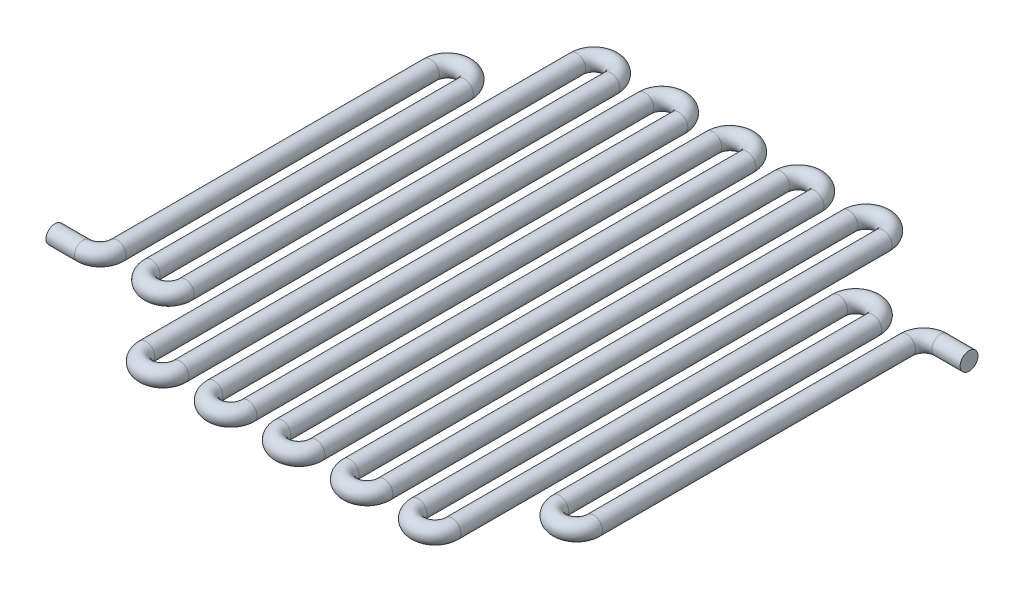
ISO-10303-21;
HEADER;
FILE_DESCRIPTION(('STEP AP214'),'2;1');
FILE_NAME('part.step','',(''),(''),'','','');
FILE_SCHEMA(('AUTOMOTIVE_DESIGN { 1 0 10303 214 1 1 1 1 }'));
ENDSEC;
DATA;
#1=APPLICATION_CONTEXT('core data for automotive mechanical design processes');
#2=APPLICATION_PROTOCOL_DEFINITION('international standard','automotive_design',2000,#1);
#3=PRODUCT_CONTEXT('',#1,'mechanical');
#4=PRODUCT('Part','Part','',(#3));
#5=PRODUCT_RELATED_PRODUCT_CATEGORY('part','',(#4));
#6=PRODUCT_DEFINITION_FORMATION('','',#4);
#7=PRODUCT_DEFINITION_CONTEXT('part definition',#1,'design');
#8=PRODUCT_DEFINITION('design','',#6,#7);
#9=PRODUCT_DEFINITION_SHAPE('','',#8);
#10=(LENGTH_UNIT() NAMED_UNIT(*) SI_UNIT(.MILLI.,.METRE.));
#11=(NAMED_UNIT(*) PLANE_ANGLE_UNIT() SI_UNIT($,.RADIAN.));
#12=(NAMED_UNIT(*) SI_UNIT($,.STERADIAN.) SOLID_ANGLE_UNIT());
#13=UNCERTAINTY_MEASURE_WITH_UNIT(LENGTH_MEASURE(1.E-05),#10,'distance_accuracy_value','');
#14=(GEOMETRIC_REPRESENTATION_CONTEXT(3) GLOBAL_UNCERTAINTY_ASSIGNED_CONTEXT((#13)) GLOBAL_UNIT_ASSIGNED_CONTEXT((#10,
#11,#12)) REPRESENTATION_CONTEXT('',''));
#15=CARTESIAN_POINT('',(0.,0.,0.));
#16=DIRECTION('',(0.,0.,1.));
#17=DIRECTION('',(1.,0.,0.));
#18=AXIS2_PLACEMENT_3D('',#15,#16,#17);
#19=CARTESIAN_POINT('',(-39.485365117506,0.,19.7125522489483));
#20=DIRECTION('',(1.,0.,0.));
#21=DIRECTION('',(0.,0.,-1.));
#22=AXIS2_PLACEMENT_3D('',#19,#20,#21);
#23=CYLINDRICAL_SURFACE('',#22,1.00000054);
#24=CARTESIAN_POINT('',(-28.575,0.,19.7125522489483));
#25=DIRECTION('',(1.,0.,0.));
#26=DIRECTION('',(0.,0.,-1.));
#27=AXIS2_PLACEMENT_3D('',#24,#25,#26);
#28=CIRCLE('',#27,1.00000054);
#29=CARTESIAN_POINT('',(-28.5749999999999,0.,20.7125527889484));
#30=VERTEX_POINT('',#29);
#31=EDGE_CURVE('E139',#30,#30,#28,.T.);
#32=ORIENTED_EDGE('',*,*,#31,.F.);
#33=EDGE_LOOP('',(#32));
#34=FACE_BOUND('',#33,.T.);
#35=CARTESIAN_POINT('',(-31.75,0.,19.7125522489483));
#36=DIRECTION('',(-1.,0.,0.));
#37=DIRECTION('',(0.,0.,1.));
#38=AXIS2_PLACEMENT_3D('',#35,#36,#37);
#39=CIRCLE('',#38,1.00000054);
#40=CARTESIAN_POINT('',(-31.75,0.,20.7125527889483));
#41=VERTEX_POINT('',#40);
#42=EDGE_CURVE('E10',#41,#41,#39,.F.);
#43=ORIENTED_EDGE('',*,*,#42,.T.);
#44=EDGE_LOOP('',(#43));
#45=FACE_BOUND('',#44,.T.);
#46=ADVANCED_FACE('F32',(#34,#45),#23,.T.);
#47=CARTESIAN_POINT('',(-28.5750000000002,0.,17.8075522489484));
#48=DIRECTION('',(0.,1.,0.));
#49=DIRECTION('',(0.,0.,1.));
#50=AXIS2_PLACEMENT_3D('',#47,#48,#49);
#51=TOROIDAL_SURFACE('',#50,1.90499999999997,1.00000054);
#52=CARTESIAN_POINT('',(-26.6700000000002,0.,17.8075522489484));
#53=DIRECTION('',(0.,0.,-1.));
#54=DIRECTION('',(-1.,0.,0.));
#55=AXIS2_PLACEMENT_3D('',#52,#53,#54);
#56=CIRCLE('',#55,1.00000054);
#57=CARTESIAN_POINT('',(-25.6699994600002,0.,17.8075522489484));
#58=VERTEX_POINT('',#57);
#59=EDGE_CURVE('E136',#58,#58,#56,.T.);
#60=CARTESIAN_POINT('',(-28.5750000000002,0.,17.8075522489484));
#61=DIRECTION('',(0.,1.,0.));
#62=DIRECTION('',(0.,0.,1.));
#63=AXIS2_PLACEMENT_3D('',#60,#61,#62);
#64=CIRCLE('',#63,2.90500053999997);
#65=EDGE_CURVE('',#30,#58,#64,.T.);
#66=ORIENTED_EDGE('',*,*,#31,.T.);
#67=ORIENTED_EDGE('',*,*,#59,.F.);
#68=ORIENTED_EDGE('',*,*,#65,.T.);
#69=ORIENTED_EDGE('',*,*,#65,.F.);
#70=EDGE_LOOP('',(#66,#68,#67,#69));
#71=FACE_BOUND('',#70,.T.);
#72=ADVANCED_FACE('F143',(#71),#51,.T.);
#73=CARTESIAN_POINT('',(-26.67,0.,17.8075522489484));
#74=DIRECTION('',(0.,0.,-1.));
#75=DIRECTION('',(-1.,0.,0.));
#76=AXIS2_PLACEMENT_3D('',#73,#74,#75);
#77=CYLINDRICAL_SURFACE('',#76,1.00000054);
#78=CARTESIAN_POINT('',(-26.6700000000002,0.,-17.2539487757863));
#79=DIRECTION('',(0.,0.,-1.));
#80=DIRECTION('',(-1.,0.,0.));
#81=AXIS2_PLACEMENT_3D('',#78,#79,#80);
#82=CIRCLE('',#81,1.00000054);
#83=CARTESIAN_POINT('',(-27.6700005400002,0.,-17.2539487757863));
#84=VERTEX_POINT('',#83);
#85=EDGE_CURVE('E133',#84,#84,#82,.T.);
#86=ORIENTED_EDGE('',*,*,#85,.F.);
#87=EDGE_LOOP('',(#86));
#88=FACE_BOUND('',#87,.T.);
#89=ORIENTED_EDGE('',*,*,#59,.T.);
#90=EDGE_LOOP('',(#89));
#91=FACE_BOUND('',#90,.T.);
#92=ADVANCED_FACE('F150',(#88,#91),#77,.T.);
#93=CARTESIAN_POINT('',(-24.765,0.,-17.2539487757863));
#94=DIRECTION('',(0.,-1.,0.));
#95=DIRECTION('',(0.,0.,-1.));
#96=AXIS2_PLACEMENT_3D('',#93,#94,#95);
#97=TOROIDAL_SURFACE('',#96,1.90500000000018,1.00000054);
#98=CARTESIAN_POINT('',(-22.8599999999998,0.,-17.2539487757863));
#99=DIRECTION('',(0.,0.,1.));
#100=DIRECTION('',(1.,0.,0.));
#101=AXIS2_PLACEMENT_3D('',#98,#99,#100);
#102=CIRCLE('',#101,1.00000054);
#103=CARTESIAN_POINT('',(-21.8599994599998,0.,-17.2539487757863));
#104=VERTEX_POINT('',#103);
#105=EDGE_CURVE('E130',#104,#104,#102,.T.);
#106=CARTESIAN_POINT('',(-24.765,0.,-17.2539487757863));
#107=DIRECTION('',(0.,-1.,0.));
#108=DIRECTION('',(0.,0.,-1.));
#109=AXIS2_PLACEMENT_3D('',#106,#107,#108);
#110=CIRCLE('',#109,2.90500054000018);
#111=EDGE_CURVE('',#84,#104,#110,.T.);
#112=ORIENTED_EDGE('',*,*,#85,.T.);
#113=ORIENTED_EDGE('',*,*,#105,.F.);
#114=ORIENTED_EDGE('',*,*,#111,.T.);
#115=ORIENTED_EDGE('',*,*,#111,.F.);
#116=EDGE_LOOP('',(#112,#114,#113,#115));
#117=FACE_BOUND('',#116,.T.);
#118=ADVANCED_FACE('F328',(#117),#97,.T.);
#119=CARTESIAN_POINT('',(-22.8599999999998,0.,-17.2539487757863));
#120=DIRECTION('',(0.,0.,1.));
#121=DIRECTION('',(1.,0.,0.));
#122=AXIS2_PLACEMENT_3D('',#119,#120,#121);
#123=CYLINDRICAL_SURFACE('',#122,1.00000054);
#124=CARTESIAN_POINT('',(-22.86,0.,17.8075522489485));
#125=DIRECTION('',(0.,0.,1.));
#126=DIRECTION('',(1.,0.,0.));
#127=AXIS2_PLACEMENT_3D('',#124,#125,#126);
#128=CIRCLE('',#127,1.00000054);
#129=CARTESIAN_POINT('',(-23.8600005400001,0.,17.8075522489485));
#130=VERTEX_POINT('',#129);
#131=EDGE_CURVE('E127',#130,#130,#128,.T.);
#132=ORIENTED_EDGE('',*,*,#131,.F.);
#133=EDGE_LOOP('',(#132));
#134=FACE_BOUND('',#133,.T.);
#135=ORIENTED_EDGE('',*,*,#105,.T.);
#136=EDGE_LOOP('',(#135));
#137=FACE_BOUND('',#136,.T.);
#138=ADVANCED_FACE('F322',(#134,#137),#123,.T.);
#139=CARTESIAN_POINT('',(-20.9550000000002,0.,17.8075522489485));
#140=DIRECTION('',(0.,1.,0.));
#141=DIRECTION('',(0.,0.,1.));
#142=AXIS2_PLACEMENT_3D('',#139,#140,#141);
#143=TOROIDAL_SURFACE('',#142,1.90499999999997,1.00000054);
#144=CARTESIAN_POINT('',(-19.0500000000002,0.,17.8075522489484));
#145=DIRECTION('',(0.,0.,-1.));
#146=DIRECTION('',(-1.,0.,0.));
#147=AXIS2_PLACEMENT_3D('',#144,#145,#146);
#148=CIRCLE('',#147,1.00000054);
#149=CARTESIAN_POINT('',(-18.0499994600002,0.,17.8075522489484));
#150=VERTEX_POINT('',#149);
#151=EDGE_CURVE('E124',#150,#150,#148,.T.);
#152=CARTESIAN_POINT('',(-20.9550000000002,0.,17.8075522489485));
#153=DIRECTION('',(0.,1.,0.));
#154=DIRECTION('',(0.,0.,1.));
#155=AXIS2_PLACEMENT_3D('',#152,#153,#154);
#156=CIRCLE('',#155,2.90500053999997);
#157=EDGE_CURVE('',#130,#150,#156,.T.);
#158=ORIENTED_EDGE('',*,*,#131,.T.);
#159=ORIENTED_EDGE('',*,*,#151,.F.);
#160=ORIENTED_EDGE('',*,*,#157,.T.);
#161=ORIENTED_EDGE('',*,*,#157,.F.);
#162=EDGE_LOOP('',(#158,#160,#159,#161));
#163=FACE_BOUND('',#162,.T.);
#164=ADVANCED_FACE('F316',(#163),#143,.T.);
#165=CARTESIAN_POINT('',(-19.05,0.,17.8075522489484));
#166=DIRECTION('',(0.,0.,-1.));
#167=DIRECTION('',(-1.,0.,0.));
#168=AXIS2_PLACEMENT_3D('',#165,#166,#167);
#169=CYLINDRICAL_SURFACE('',#168,1.00000054);
#170=CARTESIAN_POINT('',(-19.0500000000003,0.,-26.035));
#171=DIRECTION('',(0.,0.,-1.));
#172=DIRECTION('',(-1.,0.,0.));
#173=AXIS2_PLACEMENT_3D('',#170,#171,#172);
#174=CIRCLE('',#173,1.00000054);
#175=CARTESIAN_POINT('',(-20.0500005400003,0.,-26.035));
#176=VERTEX_POINT('',#175);
#177=EDGE_CURVE('E121',#176,#176,#174,.T.);
#178=ORIENTED_EDGE('',*,*,#177,.F.);
#179=EDGE_LOOP('',(#178));
#180=FACE_BOUND('',#179,.T.);
#181=ORIENTED_EDGE('',*,*,#151,.T.);
#182=EDGE_LOOP('',(#181));
#183=FACE_BOUND('',#182,.T.);
#184=ADVANCED_FACE('F310',(#180,#183),#169,.T.);
#185=CARTESIAN_POINT('',(-17.1450000000002,0.,-26.035));
#186=DIRECTION('',(0.,-1.,0.));
#187=DIRECTION('',(0.,0.,-1.));
#188=AXIS2_PLACEMENT_3D('',#185,#186,#187);
#189=TOROIDAL_SURFACE('',#188,1.90500000000018,1.00000054);
#190=CARTESIAN_POINT('',(-15.24,0.,-26.035));
#191=DIRECTION('',(0.,0.,1.));
#192=DIRECTION('',(1.,0.,0.));
#193=AXIS2_PLACEMENT_3D('',#190,#191,#192);
#194=CIRCLE('',#193,1.00000054);
#195=CARTESIAN_POINT('',(-14.23999946,0.,-26.035));
#196=VERTEX_POINT('',#195);
#197=EDGE_CURVE('E118',#196,#196,#194,.T.);
#198=CARTESIAN_POINT('',(-17.1450000000002,0.,-26.035));
#199=DIRECTION('',(0.,-1.,0.));
#200=DIRECTION('',(0.,0.,-1.));
#201=AXIS2_PLACEMENT_3D('',#198,#199,#200);
#202=CIRCLE('',#201,2.90500054000018);
#203=EDGE_CURVE('',#176,#196,#202,.T.);
#204=ORIENTED_EDGE('',*,*,#177,.T.);
#205=ORIENTED_EDGE('',*,*,#197,.F.);
#206=ORIENTED_EDGE('',*,*,#203,.T.);
#207=ORIENTED_EDGE('',*,*,#203,.F.);
#208=EDGE_LOOP('',(#204,#206,#205,#207));
#209=FACE_BOUND('',#208,.T.);
#210=ADVANCED_FACE('F304',(#209),#189,.T.);
#211=CARTESIAN_POINT('',(-15.24,0.,-26.035));
#212=DIRECTION('',(0.,0.,1.));
#213=DIRECTION('',(1.,0.,0.));
#214=AXIS2_PLACEMENT_3D('',#211,#212,#213);
#215=CYLINDRICAL_SURFACE('',#214,1.00000054);
#216=CARTESIAN_POINT('',(-15.24,0.,26.0350000000002));
#217=DIRECTION('',(0.,0.,1.));
#218=DIRECTION('',(1.,0.,0.));
#219=AXIS2_PLACEMENT_3D('',#216,#217,#218);
#220=CIRCLE('',#219,1.00000054);
#221=CARTESIAN_POINT('',(-16.24000054,0.,26.0350000000002));
#222=VERTEX_POINT('',#221);
#223=EDGE_CURVE('E115',#222,#222,#220,.T.);
#224=ORIENTED_EDGE('',*,*,#223,.F.);
#225=EDGE_LOOP('',(#224));
#226=FACE_BOUND('',#225,.T.);
#227=ORIENTED_EDGE('',*,*,#197,.T.);
#228=EDGE_LOOP('',(#227));
#229=FACE_BOUND('',#228,.T.);
#230=ADVANCED_FACE('F298',(#226,#229),#215,.T.);
#231=CARTESIAN_POINT('',(-13.3350000000002,0.,26.0350000000002));
#232=DIRECTION('',(0.,1.,0.));
#233=DIRECTION('',(0.,0.,1.));
#234=AXIS2_PLACEMENT_3D('',#231,#232,#233);
#235=TOROIDAL_SURFACE('',#234,1.90499999999982,1.00000054);
#236=CARTESIAN_POINT('',(-11.4300000000003,0.,26.0350000000003));
#237=DIRECTION('',(0.,0.,-1.));
#238=DIRECTION('',(-1.,0.,0.));
#239=AXIS2_PLACEMENT_3D('',#236,#237,#238);
#240=CIRCLE('',#239,1.00000054);
#241=CARTESIAN_POINT('',(-10.4299994600003,0.,26.0350000000003));
#242=VERTEX_POINT('',#241);
#243=EDGE_CURVE('E112',#242,#242,#240,.T.);
#244=CARTESIAN_POINT('',(-13.3350000000002,0.,26.0350000000002));
#245=DIRECTION('',(0.,1.,0.));
#246=DIRECTION('',(0.,0.,1.));
#247=AXIS2_PLACEMENT_3D('',#244,#245,#246);
#248=CIRCLE('',#247,2.90500053999982);
#249=EDGE_CURVE('',#222,#242,#248,.T.);
#250=ORIENTED_EDGE('',*,*,#223,.T.);
#251=ORIENTED_EDGE('',*,*,#243,.F.);
#252=ORIENTED_EDGE('',*,*,#249,.T.);
#253=ORIENTED_EDGE('',*,*,#249,.F.);
#254=EDGE_LOOP('',(#250,#252,#251,#253));
#255=FACE_BOUND('',#254,.T.);
#256=ADVANCED_FACE('F292',(#255),#235,.T.);
#257=CARTESIAN_POINT('',(-11.4300000000003,0.,26.0350000000002));
#258=DIRECTION('',(0.,0.,-1.));
#259=DIRECTION('',(-1.,0.,0.));
#260=AXIS2_PLACEMENT_3D('',#257,#258,#259);
#261=CYLINDRICAL_SURFACE('',#260,1.00000054);
#262=CARTESIAN_POINT('',(-11.4300000000003,0.,-26.035));
#263=DIRECTION('',(0.,0.,-1.));
#264=DIRECTION('',(-1.,0.,0.));
#265=AXIS2_PLACEMENT_3D('',#262,#263,#264);
#266=CIRCLE('',#265,1.00000054);
#267=CARTESIAN_POINT('',(-12.4300005400003,0.,-26.035));
#268=VERTEX_POINT('',#267);
#269=EDGE_CURVE('E109',#268,#268,#266,.T.);
#270=ORIENTED_EDGE('',*,*,#269,.F.);
#271=EDGE_LOOP('',(#270));
#272=FACE_BOUND('',#271,.T.);
#273=ORIENTED_EDGE('',*,*,#243,.T.);
#274=EDGE_LOOP('',(#273));
#275=FACE_BOUND('',#274,.T.);
#276=ADVANCED_FACE('F286',(#272,#275),#261,.T.);
#277=CARTESIAN_POINT('',(-9.52500000000017,0.,-26.0350000000001));
#278=DIRECTION('',(0.,-1.,0.));
#279=DIRECTION('',(0.,0.,-1.));
#280=AXIS2_PLACEMENT_3D('',#277,#278,#279);
#281=TOROIDAL_SURFACE('',#280,1.90500000000017,1.00000054);
#282=CARTESIAN_POINT('',(-7.62,0.,-26.0350000000001));
#283=DIRECTION('',(0.,0.,1.));
#284=DIRECTION('',(1.,0.,0.));
#285=AXIS2_PLACEMENT_3D('',#282,#283,#284);
#286=CIRCLE('',#285,1.00000054);
#287=CARTESIAN_POINT('',(-6.61999946,0.,-26.0350000000001));
#288=VERTEX_POINT('',#287);
#289=EDGE_CURVE('E106',#288,#288,#286,.T.);
#290=CARTESIAN_POINT('',(-9.52500000000017,0.,-26.0350000000001));
#291=DIRECTION('',(0.,-1.,0.));
#292=DIRECTION('',(0.,0.,-1.));
#293=AXIS2_PLACEMENT_3D('',#290,#291,#292);
#294=CIRCLE('',#293,2.90500054000017);
#295=EDGE_CURVE('',#268,#288,#294,.T.);
#296=ORIENTED_EDGE('',*,*,#269,.T.);
#297=ORIENTED_EDGE('',*,*,#289,.F.);
#298=ORIENTED_EDGE('',*,*,#295,.T.);
#299=ORIENTED_EDGE('',*,*,#295,.F.);
#300=EDGE_LOOP('',(#296,#298,#297,#299));
#301=FACE_BOUND('',#300,.T.);
#302=ADVANCED_FACE('F280',(#301),#281,.T.);
#303=CARTESIAN_POINT('',(-7.62,0.,-26.0350000000001));
#304=DIRECTION('',(0.,0.,1.));
#305=DIRECTION('',(1.,0.,0.));
#306=AXIS2_PLACEMENT_3D('',#303,#304,#305);
#307=CYLINDRICAL_SURFACE('',#306,1.00000054);
#308=CARTESIAN_POINT('',(-7.62,0.,26.0350000000002));
#309=DIRECTION('',(0.,0.,1.));
#310=DIRECTION('',(1.,0.,0.));
#311=AXIS2_PLACEMENT_3D('',#308,#309,#310);
#312=CIRCLE('',#311,1.00000054);
#313=CARTESIAN_POINT('',(-8.62000054,0.,26.0350000000002));
#314=VERTEX_POINT('',#313);
#315=EDGE_CURVE('E103',#314,#314,#312,.T.);
#316=ORIENTED_EDGE('',*,*,#315,.F.);
#317=EDGE_LOOP('',(#316));
#318=FACE_BOUND('',#317,.T.);
#319=ORIENTED_EDGE('',*,*,#289,.T.);
#320=EDGE_LOOP('',(#319));
#321=FACE_BOUND('',#320,.T.);
#322=ADVANCED_FACE('F274',(#318,#321),#307,.T.);
#323=CARTESIAN_POINT('',(-5.71500000000017,0.,26.0350000000002));
#324=DIRECTION('',(0.,1.,0.));
#325=DIRECTION('',(0.,0.,1.));
#326=AXIS2_PLACEMENT_3D('',#323,#324,#325);
#327=TOROIDAL_SURFACE('',#326,1.90499999999982,1.00000054);
#328=CARTESIAN_POINT('',(-3.81000000000035,0.,26.0350000000001));
#329=DIRECTION('',(0.,0.,-1.));
#330=DIRECTION('',(-1.,0.,0.));
#331=AXIS2_PLACEMENT_3D('',#328,#329,#330);
#332=CIRCLE('',#331,1.00000054);
#333=CARTESIAN_POINT('',(-2.80999946000035,0.,26.0350000000001));
#334=VERTEX_POINT('',#333);
#335=EDGE_CURVE('E100',#334,#334,#332,.T.);
#336=CARTESIAN_POINT('',(-5.71500000000017,0.,26.0350000000002));
#337=DIRECTION('',(0.,1.,0.));
#338=DIRECTION('',(0.,0.,1.));
#339=AXIS2_PLACEMENT_3D('',#336,#337,#338);
#340=CIRCLE('',#339,2.90500053999982);
#341=EDGE_CURVE('',#314,#334,#340,.T.);
#342=ORIENTED_EDGE('',*,*,#315,.T.);
#343=ORIENTED_EDGE('',*,*,#335,.F.);
#344=ORIENTED_EDGE('',*,*,#341,.T.);
#345=ORIENTED_EDGE('',*,*,#341,.F.);
#346=EDGE_LOOP('',(#342,#344,#343,#345));
#347=FACE_BOUND('',#346,.T.);
#348=ADVANCED_FACE('F268',(#347),#327,.T.);
#349=CARTESIAN_POINT('',(-3.81000000000035,0.,26.0350000000001));
#350=DIRECTION('',(0.,0.,-1.));
#351=DIRECTION('',(-1.,0.,0.));
#352=AXIS2_PLACEMENT_3D('',#349,#350,#351);
#353=CYLINDRICAL_SURFACE('',#352,1.00000054);
#354=CARTESIAN_POINT('',(-3.81000000000035,0.,-26.0350000000001));
#355=DIRECTION('',(0.,0.,-1.));
#356=DIRECTION('',(-1.,0.,0.));
#357=AXIS2_PLACEMENT_3D('',#354,#355,#356);
#358=CIRCLE('',#357,1.00000054);
#359=CARTESIAN_POINT('',(-4.81000054000035,0.,-26.0350000000001));
#360=VERTEX_POINT('',#359);
#361=EDGE_CURVE('E97',#360,#360,#358,.T.);
#362=ORIENTED_EDGE('',*,*,#361,.F.);
#363=EDGE_LOOP('',(#362));
#364=FACE_BOUND('',#363,.T.);
#365=ORIENTED_EDGE('',*,*,#335,.T.);
#366=EDGE_LOOP('',(#365));
#367=FACE_BOUND('',#366,.T.);
#368=ADVANCED_FACE('F262',(#364,#367),#353,.T.);
#369=CARTESIAN_POINT('',(-1.90500000000018,0.,-26.0350000000001));
#370=DIRECTION('',(0.,-1.,0.));
#371=DIRECTION('',(0.,0.,-1.));
#372=AXIS2_PLACEMENT_3D('',#369,#370,#371);
#373=TOROIDAL_SURFACE('',#372,1.90500000000018,1.00000054);
#374=CARTESIAN_POINT('',(0.,0.,-26.0350000000001));
#375=DIRECTION('',(0.,0.,1.));
#376=DIRECTION('',(1.,0.,0.));
#377=AXIS2_PLACEMENT_3D('',#374,#375,#376);
#378=CIRCLE('',#377,1.00000054);
#379=CARTESIAN_POINT('',(1.00000054,0.,-26.0350000000001));
#380=VERTEX_POINT('',#379);
#381=EDGE_CURVE('E94',#380,#380,#378,.T.);
#382=CARTESIAN_POINT('',(-1.90500000000018,0.,-26.0350000000001));
#383=DIRECTION('',(0.,-1.,0.));
#384=DIRECTION('',(0.,0.,-1.));
#385=AXIS2_PLACEMENT_3D('',#382,#383,#384);
#386=CIRCLE('',#385,2.90500054000018);
#387=EDGE_CURVE('',#360,#380,#386,.T.);
#388=ORIENTED_EDGE('',*,*,#361,.T.);
#389=ORIENTED_EDGE('',*,*,#381,.F.);
#390=ORIENTED_EDGE('',*,*,#387,.T.);
#391=ORIENTED_EDGE('',*,*,#387,.F.);
#392=EDGE_LOOP('',(#388,#390,#389,#391));
#393=FACE_BOUND('',#392,.T.);
#394=ADVANCED_FACE('F256',(#393),#373,.T.);
#395=CARTESIAN_POINT('',(0.,0.,-26.0350000000001));
#396=DIRECTION('',(0.,0.,1.));
#397=DIRECTION('',(1.,0.,0.));
#398=AXIS2_PLACEMENT_3D('',#395,#396,#397);
#399=CYLINDRICAL_SURFACE('',#398,1.00000054);
#400=CARTESIAN_POINT('',(0.,0.,26.0350000000001));
#401=DIRECTION('',(0.,0.,1.));
#402=DIRECTION('',(1.,0.,0.));
#403=AXIS2_PLACEMENT_3D('',#400,#401,#402);
#404=CIRCLE('',#403,1.00000054);
#405=CARTESIAN_POINT('',(-1.00000054,0.,26.0350000000001));
#406=VERTEX_POINT('',#405);
#407=EDGE_CURVE('E91',#406,#406,#404,.T.);
#408=ORIENTED_EDGE('',*,*,#407,.F.);
#409=EDGE_LOOP('',(#408));
#410=FACE_BOUND('',#409,.T.);
#411=ORIENTED_EDGE('',*,*,#381,.T.);
#412=EDGE_LOOP('',(#411));
#413=FACE_BOUND('',#412,.T.);
#414=ADVANCED_FACE('F250',(#410,#413),#399,.T.);
#415=CARTESIAN_POINT('',(1.90499999999982,0.,26.0350000000001));
#416=DIRECTION('',(0.,1.,0.));
#417=DIRECTION('',(0.,0.,1.));
#418=AXIS2_PLACEMENT_3D('',#415,#416,#417);
#419=TOROIDAL_SURFACE('',#418,1.90499999999982,1.00000054);
#420=CARTESIAN_POINT('',(3.80999999999965,0.,26.0350000000001));
#421=DIRECTION('',(0.,0.,-1.));
#422=DIRECTION('',(-1.,0.,0.));
#423=AXIS2_PLACEMENT_3D('',#420,#421,#422);
#424=CIRCLE('',#423,1.00000054);
#425=CARTESIAN_POINT('',(4.81000053999965,0.,26.0350000000002));
#426=VERTEX_POINT('',#425);
#427=EDGE_CURVE('E88',#426,#426,#424,.T.);
#428=CARTESIAN_POINT('',(1.90499999999982,0.,26.0350000000001));
#429=DIRECTION('',(0.,1.,0.));
#430=DIRECTION('',(0.,0.,1.));
#431=AXIS2_PLACEMENT_3D('',#428,#429,#430);
#432=CIRCLE('',#431,2.90500053999982);
#433=EDGE_CURVE('',#406,#426,#432,.T.);
#434=ORIENTED_EDGE('',*,*,#407,.T.);
#435=ORIENTED_EDGE('',*,*,#427,.F.);
#436=ORIENTED_EDGE('',*,*,#433,.T.);
#437=ORIENTED_EDGE('',*,*,#433,.F.);
#438=EDGE_LOOP('',(#434,#436,#435,#437));
#439=FACE_BOUND('',#438,.T.);
#440=ADVANCED_FACE('F244',(#439),#419,.T.);
#441=CARTESIAN_POINT('',(3.80999999999965,0.,26.0350000000001));
#442=DIRECTION('',(0.,0.,-1.));
#443=DIRECTION('',(-1.,0.,0.));
#444=AXIS2_PLACEMENT_3D('',#441,#442,#443);
#445=CYLINDRICAL_SURFACE('',#444,1.00000054);
#446=CARTESIAN_POINT('',(3.80999999999965,0.,-26.0350000000001));
#447=DIRECTION('',(0.,0.,-1.));
#448=DIRECTION('',(-1.,0.,0.));
#449=AXIS2_PLACEMENT_3D('',#446,#447,#448);
#450=CIRCLE('',#449,1.00000054);
#451=CARTESIAN_POINT('',(2.80999945999965,0.,-26.0350000000001));
#452=VERTEX_POINT('',#451);
#453=EDGE_CURVE('E85',#452,#452,#450,.T.);
#454=ORIENTED_EDGE('',*,*,#453,.F.);
#455=EDGE_LOOP('',(#454));
#456=FACE_BOUND('',#455,.T.);
#457=ORIENTED_EDGE('',*,*,#427,.T.);
#458=EDGE_LOOP('',(#457));
#459=FACE_BOUND('',#458,.T.);
#460=ADVANCED_FACE('F238',(#456,#459),#445,.T.);
#461=CARTESIAN_POINT('',(5.71499999999982,0.,-26.0350000000001));
#462=DIRECTION('',(0.,-1.,0.));
#463=DIRECTION('',(0.,0.,-1.));
#464=AXIS2_PLACEMENT_3D('',#461,#462,#463);
#465=TOROIDAL_SURFACE('',#464,1.90500000000018,1.00000054);
#466=CARTESIAN_POINT('',(7.62,0.,-26.0350000000001));
#467=DIRECTION('',(0.,0.,1.));
#468=DIRECTION('',(1.,0.,0.));
#469=AXIS2_PLACEMENT_3D('',#466,#467,#468);
#470=CIRCLE('',#469,1.00000054);
#471=CARTESIAN_POINT('',(8.62000054,0.,-26.0350000000001));
#472=VERTEX_POINT('',#471);
#473=EDGE_CURVE('E82',#472,#472,#470,.T.);
#474=CARTESIAN_POINT('',(5.71499999999982,0.,-26.0350000000001));
#475=DIRECTION('',(0.,-1.,0.));
#476=DIRECTION('',(0.,0.,-1.));
#477=AXIS2_PLACEMENT_3D('',#474,#475,#476);
#478=CIRCLE('',#477,2.90500054000018);
#479=EDGE_CURVE('',#452,#472,#478,.T.);
#480=ORIENTED_EDGE('',*,*,#453,.T.);
#481=ORIENTED_EDGE('',*,*,#473,.F.);
#482=ORIENTED_EDGE('',*,*,#479,.T.);
#483=ORIENTED_EDGE('',*,*,#479,.F.);
#484=EDGE_LOOP('',(#480,#482,#481,#483));
#485=FACE_BOUND('',#484,.T.);
#486=ADVANCED_FACE('F232',(#485),#465,.T.);
#487=CARTESIAN_POINT('',(7.62,0.,-26.0350000000001));
#488=DIRECTION('',(0.,0.,1.));
#489=DIRECTION('',(1.,0.,0.));
#490=AXIS2_PLACEMENT_3D('',#487,#488,#489);
#491=CYLINDRICAL_SURFACE('',#490,1.00000054);
#492=CARTESIAN_POINT('',(7.62,0.,26.0350000000001));
#493=DIRECTION('',(0.,0.,1.));
#494=DIRECTION('',(1.,0.,0.));
#495=AXIS2_PLACEMENT_3D('',#492,#493,#494);
#496=CIRCLE('',#495,1.00000054);
#497=CARTESIAN_POINT('',(6.61999946,0.,26.0350000000001));
#498=VERTEX_POINT('',#497);
#499=EDGE_CURVE('E79',#498,#498,#496,.T.);
#500=ORIENTED_EDGE('',*,*,#499,.F.);
#501=EDGE_LOOP('',(#500));
#502=FACE_BOUND('',#501,.T.);
#503=ORIENTED_EDGE('',*,*,#473,.T.);
#504=EDGE_LOOP('',(#503));
#505=FACE_BOUND('',#504,.T.);
#506=ADVANCED_FACE('F226',(#502,#505),#491,.T.);
#507=CARTESIAN_POINT('',(9.52499999999982,0.,26.0350000000001));
#508=DIRECTION('',(0.,1.,0.));
#509=DIRECTION('',(0.,0.,1.));
#510=AXIS2_PLACEMENT_3D('',#507,#508,#509);
#511=TOROIDAL_SURFACE('',#510,1.90499999999982,1.00000054);
#512=CARTESIAN_POINT('',(11.4299999999996,0.,26.0350000000001));
#513=DIRECTION('',(0.,0.,-1.));
#514=DIRECTION('',(-1.,0.,0.));
#515=AXIS2_PLACEMENT_3D('',#512,#513,#514);
#516=CIRCLE('',#515,1.00000054);
#517=CARTESIAN_POINT('',(12.4300005399996,0.,26.0350000000002));
#518=VERTEX_POINT('',#517);
#519=EDGE_CURVE('E76',#518,#518,#516,.T.);
#520=CARTESIAN_POINT('',(9.52499999999982,0.,26.0350000000001));
#521=DIRECTION('',(0.,1.,0.));
#522=DIRECTION('',(0.,0.,1.));
#523=AXIS2_PLACEMENT_3D('',#520,#521,#522);
#524=CIRCLE('',#523,2.90500053999982);
#525=EDGE_CURVE('',#498,#518,#524,.T.);
#526=ORIENTED_EDGE('',*,*,#499,.T.);
#527=ORIENTED_EDGE('',*,*,#519,.F.);
#528=ORIENTED_EDGE('',*,*,#525,.T.);
#529=ORIENTED_EDGE('',*,*,#525,.F.);
#530=EDGE_LOOP('',(#526,#528,#527,#529));
#531=FACE_BOUND('',#530,.T.);
#532=ADVANCED_FACE('F220',(#531),#511,.T.);
#533=CARTESIAN_POINT('',(11.4299999999996,0.,26.0350000000001));
#534=DIRECTION('',(0.,0.,-1.));
#535=DIRECTION('',(-1.,0.,0.));
#536=AXIS2_PLACEMENT_3D('',#533,#534,#535);
#537=CYLINDRICAL_SURFACE('',#536,1.00000054);
#538=CARTESIAN_POINT('',(11.4299999999996,0.,-26.0350000000002));
#539=DIRECTION('',(0.,0.,-1.));
#540=DIRECTION('',(-1.,0.,0.));
#541=AXIS2_PLACEMENT_3D('',#538,#539,#540);
#542=CIRCLE('',#541,1.00000054);
#543=CARTESIAN_POINT('',(10.4299994599996,0.,-26.0350000000003));
#544=VERTEX_POINT('',#543);
#545=EDGE_CURVE('E73',#544,#544,#542,.T.);
#546=ORIENTED_EDGE('',*,*,#545,.F.);
#547=EDGE_LOOP('',(#546));
#548=FACE_BOUND('',#547,.T.);
#549=ORIENTED_EDGE('',*,*,#519,.T.);
#550=EDGE_LOOP('',(#549));
#551=FACE_BOUND('',#550,.T.);
#552=ADVANCED_FACE('F214',(#548,#551),#537,.T.);
#553=CARTESIAN_POINT('',(13.3349999999998,0.,-26.0350000000001));
#554=DIRECTION('',(0.,-1.,0.));
#555=DIRECTION('',(0.,0.,-1.));
#556=AXIS2_PLACEMENT_3D('',#553,#554,#555);
#557=TOROIDAL_SURFACE('',#556,1.90500000000018,1.00000054);
#558=CARTESIAN_POINT('',(15.24,0.,-26.0350000000001));
#559=DIRECTION('',(0.,0.,1.));
#560=DIRECTION('',(1.,0.,0.));
#561=AXIS2_PLACEMENT_3D('',#558,#559,#560);
#562=CIRCLE('',#561,1.00000054);
#563=CARTESIAN_POINT('',(16.24000054,0.,-26.0350000000001));
#564=VERTEX_POINT('',#563);
#565=EDGE_CURVE('E70',#564,#564,#562,.T.);
#566=CARTESIAN_POINT('',(13.3349999999998,0.,-26.0350000000001));
#567=DIRECTION('',(0.,-1.,0.));
#568=DIRECTION('',(0.,0.,-1.));
#569=AXIS2_PLACEMENT_3D('',#566,#567,#568);
#570=CIRCLE('',#569,2.90500054000018);
#571=EDGE_CURVE('',#544,#564,#570,.T.);
#572=ORIENTED_EDGE('',*,*,#545,.T.);
#573=ORIENTED_EDGE('',*,*,#565,.F.);
#574=ORIENTED_EDGE('',*,*,#571,.T.);
#575=ORIENTED_EDGE('',*,*,#571,.F.);
#576=EDGE_LOOP('',(#572,#574,#573,#575));
#577=FACE_BOUND('',#576,.T.);
#578=ADVANCED_FACE('F208',(#577),#557,.T.);
#579=CARTESIAN_POINT('',(15.24,0.,-26.0350000000001));
#580=DIRECTION('',(0.,0.,1.));
#581=DIRECTION('',(1.,0.,0.));
#582=AXIS2_PLACEMENT_3D('',#579,#580,#581);
#583=CYLINDRICAL_SURFACE('',#582,1.00000054);
#584=CARTESIAN_POINT('',(15.24,0.,26.0350000000001));
#585=DIRECTION('',(0.,0.,1.));
#586=DIRECTION('',(1.,0.,0.));
#587=AXIS2_PLACEMENT_3D('',#584,#585,#586);
#588=CIRCLE('',#587,1.00000054);
#589=CARTESIAN_POINT('',(14.23999946,0.,26.0350000000001));
#590=VERTEX_POINT('',#589);
#591=EDGE_CURVE('E67',#590,#590,#588,.T.);
#592=ORIENTED_EDGE('',*,*,#591,.F.);
#593=EDGE_LOOP('',(#592));
#594=FACE_BOUND('',#593,.T.);
#595=ORIENTED_EDGE('',*,*,#565,.T.);
#596=EDGE_LOOP('',(#595));
#597=FACE_BOUND('',#596,.T.);
#598=ADVANCED_FACE('F202',(#594,#597),#583,.T.);
#599=CARTESIAN_POINT('',(17.1449999999998,0.,26.0350000000001));
#600=DIRECTION('',(0.,1.,0.));
#601=DIRECTION('',(0.,0.,1.));
#602=AXIS2_PLACEMENT_3D('',#599,#600,#601);
#603=TOROIDAL_SURFACE('',#602,1.90499999999983,1.00000054);
#604=CARTESIAN_POINT('',(19.0499999999996,0.,26.0350000000001));
#605=DIRECTION('',(0.,0.,-1.));
#606=DIRECTION('',(-1.,0.,0.));
#607=AXIS2_PLACEMENT_3D('',#604,#605,#606);
#608=CIRCLE('',#607,1.00000054);
#609=CARTESIAN_POINT('',(20.0500005399996,0.,26.0350000000002));
#610=VERTEX_POINT('',#609);
#611=EDGE_CURVE('E64',#610,#610,#608,.T.);
#612=CARTESIAN_POINT('',(17.1449999999998,0.,26.0350000000001));
#613=DIRECTION('',(0.,1.,0.));
#614=DIRECTION('',(0.,0.,1.));
#615=AXIS2_PLACEMENT_3D('',#612,#613,#614);
#616=CIRCLE('',#615,2.90500053999983);
#617=EDGE_CURVE('',#590,#610,#616,.T.);
#618=ORIENTED_EDGE('',*,*,#591,.T.);
#619=ORIENTED_EDGE('',*,*,#611,.F.);
#620=ORIENTED_EDGE('',*,*,#617,.T.);
#621=ORIENTED_EDGE('',*,*,#617,.F.);
#622=EDGE_LOOP('',(#618,#620,#619,#621));
#623=FACE_BOUND('',#622,.T.);
#624=ADVANCED_FACE('F196',(#623),#603,.T.);
#625=CARTESIAN_POINT('',(19.0499999999996,0.,26.0350000000001));
#626=DIRECTION('',(0.,0.,-1.));
#627=DIRECTION('',(-1.,0.,0.));
#628=AXIS2_PLACEMENT_3D('',#625,#626,#627);
#629=CYLINDRICAL_SURFACE('',#628,1.00000054);
#630=CARTESIAN_POINT('',(19.0499999999996,0.,-17.2539487757863));
#631=DIRECTION('',(0.,0.,-1.));
#632=DIRECTION('',(-1.,0.,0.));
#633=AXIS2_PLACEMENT_3D('',#630,#631,#632);
#634=CIRCLE('',#633,1.00000054);
#635=CARTESIAN_POINT('',(18.0499994599997,0.,-17.2539487757863));
#636=VERTEX_POINT('',#635);
#637=EDGE_CURVE('E61',#636,#636,#634,.T.);
#638=ORIENTED_EDGE('',*,*,#637,.F.);
#639=EDGE_LOOP('',(#638));
#640=FACE_BOUND('',#639,.T.);
#641=ORIENTED_EDGE('',*,*,#611,.T.);
#642=EDGE_LOOP('',(#641));
#643=FACE_BOUND('',#642,.T.);
#644=ADVANCED_FACE('F190',(#640,#643),#629,.T.);
#645=CARTESIAN_POINT('',(20.955,0.,-17.2539487757863));
#646=DIRECTION('',(0.,-1.,0.));
#647=DIRECTION('',(0.,0.,-1.));
#648=AXIS2_PLACEMENT_3D('',#645,#646,#647);
#649=TOROIDAL_SURFACE('',#648,1.90500000000026,1.00000054);
#650=CARTESIAN_POINT('',(22.8600000000003,0.,-17.2539487757863));
#651=DIRECTION('',(0.,0.,1.));
#652=DIRECTION('',(1.,0.,0.));
#653=AXIS2_PLACEMENT_3D('',#650,#651,#652);
#654=CIRCLE('',#653,1.00000054);
#655=CARTESIAN_POINT('',(23.8600005400003,0.,-17.2539487757863));
#656=VERTEX_POINT('',#655);
#657=EDGE_CURVE('E58',#656,#656,#654,.T.);
#658=CARTESIAN_POINT('',(20.955,0.,-17.2539487757863));
#659=DIRECTION('',(0.,-1.,0.));
#660=DIRECTION('',(0.,0.,-1.));
#661=AXIS2_PLACEMENT_3D('',#658,#659,#660);
#662=CIRCLE('',#661,2.90500054000026);
#663=EDGE_CURVE('',#636,#656,#662,.T.);
#664=ORIENTED_EDGE('',*,*,#637,.T.);
#665=ORIENTED_EDGE('',*,*,#657,.F.);
#666=ORIENTED_EDGE('',*,*,#663,.T.);
#667=ORIENTED_EDGE('',*,*,#663,.F.);
#668=EDGE_LOOP('',(#664,#666,#665,#667));
#669=FACE_BOUND('',#668,.T.);
#670=ADVANCED_FACE('F184',(#669),#649,.T.);
#671=CARTESIAN_POINT('',(22.8600000000002,0.,-17.2539487757863));
#672=DIRECTION('',(0.,0.,1.));
#673=DIRECTION('',(1.,0.,0.));
#674=AXIS2_PLACEMENT_3D('',#671,#672,#673);
#675=CYLINDRICAL_SURFACE('',#674,1.00000054);
#676=CARTESIAN_POINT('',(22.86,0.,17.8075522489485));
#677=DIRECTION('',(0.,0.,1.));
#678=DIRECTION('',(1.,0.,0.));
#679=AXIS2_PLACEMENT_3D('',#676,#677,#678);
#680=CIRCLE('',#679,1.00000054);
#681=CARTESIAN_POINT('',(21.85999946,0.,17.8075522489485));
#682=VERTEX_POINT('',#681);
#683=EDGE_CURVE('E55',#682,#682,#680,.T.);
#684=ORIENTED_EDGE('',*,*,#683,.F.);
#685=EDGE_LOOP('',(#684));
#686=FACE_BOUND('',#685,.T.);
#687=ORIENTED_EDGE('',*,*,#657,.T.);
#688=EDGE_LOOP('',(#687));
#689=FACE_BOUND('',#688,.T.);
#690=ADVANCED_FACE('F178',(#686,#689),#675,.T.);
#691=CARTESIAN_POINT('',(24.7649999999998,0.,17.8075522489485));
#692=DIRECTION('',(0.,1.,0.));
#693=DIRECTION('',(0.,0.,1.));
#694=AXIS2_PLACEMENT_3D('',#691,#692,#693);
#695=TOROIDAL_SURFACE('',#694,1.90499999999982,1.00000054);
#696=CARTESIAN_POINT('',(26.6699999999996,0.,17.8075522489485));
#697=DIRECTION('',(0.,0.,-1.));
#698=DIRECTION('',(-1.,0.,0.));
#699=AXIS2_PLACEMENT_3D('',#696,#697,#698);
#700=CIRCLE('',#699,1.00000054);
#701=CARTESIAN_POINT('',(27.6700005399996,0.,17.8075522489485));
#702=VERTEX_POINT('',#701);
#703=EDGE_CURVE('E52',#702,#702,#700,.T.);
#704=CARTESIAN_POINT('',(24.7649999999998,0.,17.8075522489485));
#705=DIRECTION('',(0.,1.,0.));
#706=DIRECTION('',(0.,0.,1.));
#707=AXIS2_PLACEMENT_3D('',#704,#705,#706);
#708=CIRCLE('',#707,2.90500053999982);
#709=EDGE_CURVE('',#682,#702,#708,.T.);
#710=ORIENTED_EDGE('',*,*,#683,.T.);
#711=ORIENTED_EDGE('',*,*,#703,.F.);
#712=ORIENTED_EDGE('',*,*,#709,.T.);
#713=ORIENTED_EDGE('',*,*,#709,.F.);
#714=EDGE_LOOP('',(#710,#712,#711,#713));
#715=FACE_BOUND('',#714,.T.);
#716=ADVANCED_FACE('F172',(#715),#695,.T.);
#717=CARTESIAN_POINT('',(26.6699999999996,0.,17.8075522489485));
#718=DIRECTION('',(0.,0.,-1.));
#719=DIRECTION('',(-1.,0.,0.));
#720=AXIS2_PLACEMENT_3D('',#717,#718,#719);
#721=CYLINDRICAL_SURFACE('',#720,1.00000054);
#722=CARTESIAN_POINT('',(26.6699999999996,0.,-17.2539487757863));
#723=DIRECTION('',(0.,0.,-1.));
#724=DIRECTION('',(-1.,0.,0.));
#725=AXIS2_PLACEMENT_3D('',#722,#723,#724);
#726=CIRCLE('',#725,1.00000054);
#727=CARTESIAN_POINT('',(25.6699994599996,0.,-17.2539487757863));
#728=VERTEX_POINT('',#727);
#729=EDGE_CURVE('E47',#728,#728,#726,.T.);
#730=ORIENTED_EDGE('',*,*,#729,.F.);
#731=EDGE_LOOP('',(#730));
#732=FACE_BOUND('',#731,.T.);
#733=ORIENTED_EDGE('',*,*,#703,.T.);
#734=EDGE_LOOP('',(#733));
#735=FACE_BOUND('',#734,.T.);
#736=ADVANCED_FACE('F163',(#732,#735),#721,.T.);
#737=CARTESIAN_POINT('',(28.5749999999998,0.,-17.2539487757863));
#738=DIRECTION('',(0.,-1.,0.));
#739=DIRECTION('',(0.,0.,-1.));
#740=AXIS2_PLACEMENT_3D('',#737,#738,#739);
#741=TOROIDAL_SURFACE('',#740,1.90500000000018,1.00000054);
#742=CARTESIAN_POINT('',(28.5749999999998,0.,-19.1589487757865));
#743=DIRECTION('',(1.,0.,0.));
#744=DIRECTION('',(0.,0.,-1.));
#745=AXIS2_PLACEMENT_3D('',#742,#743,#744);
#746=CIRCLE('',#745,1.00000054);
#747=CARTESIAN_POINT('',(28.5749999999998,0.,-20.1589493157865));
#748=VERTEX_POINT('',#747);
#749=EDGE_CURVE('E43',#748,#748,#746,.T.);
#750=CARTESIAN_POINT('',(28.5749999999998,0.,-17.2539487757863));
#751=DIRECTION('',(0.,-1.,0.));
#752=DIRECTION('',(0.,0.,-1.));
#753=AXIS2_PLACEMENT_3D('',#750,#751,#752);
#754=CIRCLE('',#753,2.90500054000018);
#755=EDGE_CURVE('',#728,#748,#754,.T.);
#756=ORIENTED_EDGE('',*,*,#729,.T.);
#757=ORIENTED_EDGE('',*,*,#749,.F.);
#758=ORIENTED_EDGE('',*,*,#755,.T.);
#759=ORIENTED_EDGE('',*,*,#755,.F.);
#760=EDGE_LOOP('',(#756,#758,#757,#759));
#761=FACE_BOUND('',#760,.T.);
#762=ADVANCED_FACE('F156',(#761),#741,.T.);
#763=CARTESIAN_POINT('',(28.575,0.,-19.1589487757865));
#764=DIRECTION('',(1.,0.,0.));
#765=DIRECTION('',(0.,0.,-1.));
#766=AXIS2_PLACEMENT_3D('',#763,#764,#765);
#767=CYLINDRICAL_SURFACE('',#766,1.00000054);
#768=CARTESIAN_POINT('',(31.75,0.,-19.1589487757865));
#769=DIRECTION('',(-1.,0.,0.));
#770=DIRECTION('',(0.,0.,1.));
#771=AXIS2_PLACEMENT_3D('',#768,#769,#770);
#772=CIRCLE('',#771,1.00000054);
#773=CARTESIAN_POINT('',(31.75,0.,-18.1589482357865));
#774=VERTEX_POINT('',#773);
#775=EDGE_CURVE('E39',#774,#774,#772,.F.);
#776=ORIENTED_EDGE('',*,*,#775,.F.);
#777=EDGE_LOOP('',(#776));
#778=FACE_BOUND('',#777,.T.);
#779=ORIENTED_EDGE('',*,*,#749,.T.);
#780=EDGE_LOOP('',(#779));
#781=FACE_BOUND('',#780,.T.);
#782=ADVANCED_FACE('F34',(#778,#781),#767,.T.);
#783=CARTESIAN_POINT('',(31.75,-1.00000054,0.));
#784=DIRECTION('',(-1.,0.,0.));
#785=DIRECTION('',(0.,0.,1.));
#786=AXIS2_PLACEMENT_3D('',#783,#784,#785);
#787=PLANE('',#786);
#788=ORIENTED_EDGE('',*,*,#775,.T.);
#789=EDGE_LOOP('',(#788));
#790=FACE_BOUND('',#789,.T.);
#791=ADVANCED_FACE('F153',(#790),#787,.F.);
#792=CARTESIAN_POINT('',(-31.75,-1.00000054,0.));
#793=DIRECTION('',(-1.,0.,0.));
#794=DIRECTION('',(0.,0.,1.));
#795=AXIS2_PLACEMENT_3D('',#792,#793,#794);
#796=PLANE('',#795);
#797=ORIENTED_EDGE('',*,*,#42,.F.);
#798=EDGE_LOOP('',(#797));
#799=FACE_BOUND('',#798,.T.);
#800=ADVANCED_FACE('F162',(#799),#796,.T.);
#801=CLOSED_SHELL('',(#46,#72,#92,#118,#138,#164,#184,#210,#230,#256,#276,#302,#322,#348,#368,
#394,#414,#440,#460,#486,#506,#532,#552,#578,#598,#624,#644,#670,#690,#716,#736,#762,#782,#791,#800));
#802=MANIFOLD_SOLID_BREP('B2',#801);
#803=ADVANCED_BREP_SHAPE_REPRESENTATION('',(#18,#802),#14);
#804=SHAPE_DEFINITION_REPRESENTATION(#9,#803);
ENDSEC;
END-ISO-10303-21;
